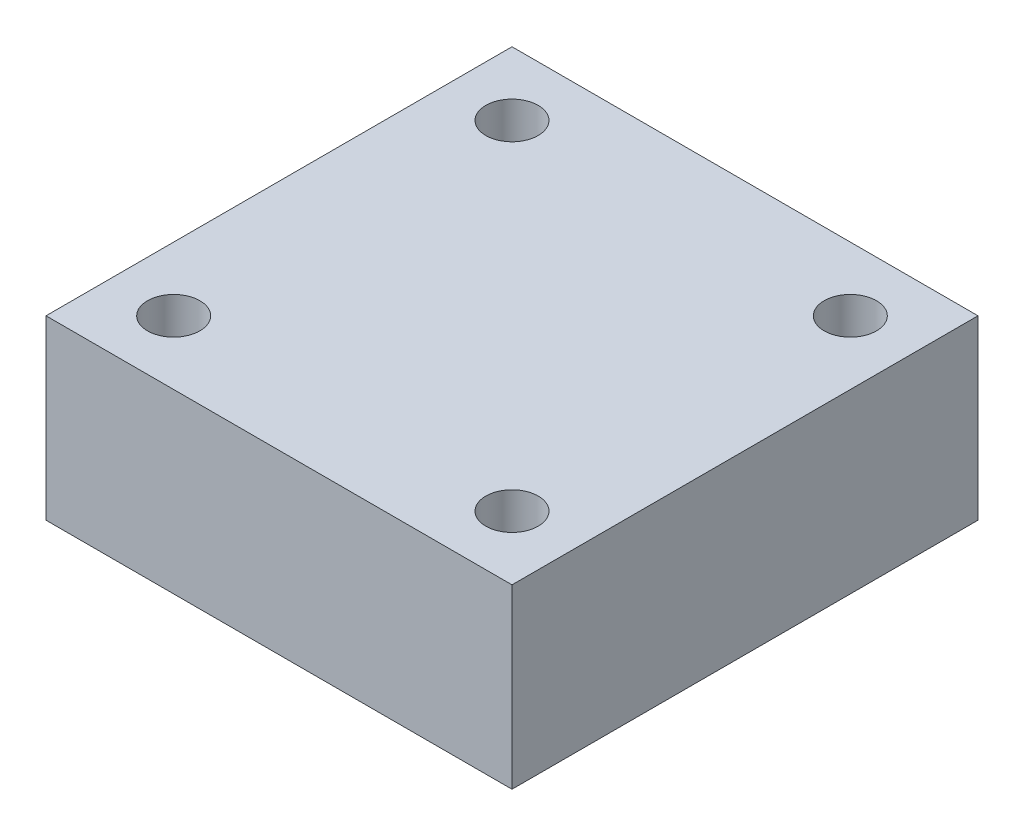
ISO-10303-21;
HEADER;
FILE_DESCRIPTION(('STEP AP214'),'2;1');
FILE_NAME('part.step','',(''),(''),'','','');
FILE_SCHEMA(('AUTOMOTIVE_DESIGN { 1 0 10303 214 1 1 1 1 }'));
ENDSEC;
DATA;
#1=APPLICATION_CONTEXT('core data for automotive mechanical design processes');
#2=APPLICATION_PROTOCOL_DEFINITION('international standard','automotive_design',2000,#1);
#3=PRODUCT_CONTEXT('',#1,'mechanical');
#4=PRODUCT('Part','Part','',(#3));
#5=PRODUCT_RELATED_PRODUCT_CATEGORY('part','',(#4));
#6=PRODUCT_DEFINITION_FORMATION('','',#4);
#7=PRODUCT_DEFINITION_CONTEXT('part definition',#1,'design');
#8=PRODUCT_DEFINITION('design','',#6,#7);
#9=PRODUCT_DEFINITION_SHAPE('','',#8);
#10=(LENGTH_UNIT() NAMED_UNIT(*) SI_UNIT(.MILLI.,.METRE.));
#11=(NAMED_UNIT(*) PLANE_ANGLE_UNIT() SI_UNIT($,.RADIAN.));
#12=(NAMED_UNIT(*) SI_UNIT($,.STERADIAN.) SOLID_ANGLE_UNIT());
#13=UNCERTAINTY_MEASURE_WITH_UNIT(LENGTH_MEASURE(1.E-05),#10,'distance_accuracy_value','');
#14=(GEOMETRIC_REPRESENTATION_CONTEXT(3) GLOBAL_UNCERTAINTY_ASSIGNED_CONTEXT((#13)) GLOBAL_UNIT_ASSIGNED_CONTEXT((#10,
#11,#12)) REPRESENTATION_CONTEXT('',''));
#15=CARTESIAN_POINT('',(0.,0.,0.));
#16=DIRECTION('',(0.,0.,1.));
#17=DIRECTION('',(1.,0.,0.));
#18=AXIS2_PLACEMENT_3D('',#15,#16,#17);
#19=CARTESIAN_POINT('',(0.,27.734,0.));
#20=DIRECTION('',(0.,-1.,0.));
#21=DIRECTION('',(0.,0.,-1.));
#22=AXIS2_PLACEMENT_3D('',#19,#20,#21);
#23=PLANE('',#22);
#24=DIRECTION('',(0.,0.,-1.));
#25=VECTOR('',#24,1.);
#26=CARTESIAN_POINT('',(36.5,27.734,36.5));
#27=LINE('',#26,#25);
#28=CARTESIAN_POINT('',(36.5,27.734,36.5));
#29=VERTEX_POINT('',#28);
#30=CARTESIAN_POINT('',(36.5,27.734,-36.5));
#31=VERTEX_POINT('',#30);
#32=EDGE_CURVE('E92',#29,#31,#27,.T.);
#33=ORIENTED_EDGE('',*,*,#32,.T.);
#34=DIRECTION('',(-1.,0.,0.));
#35=VECTOR('',#34,1.);
#36=CARTESIAN_POINT('',(-36.5,27.734,-36.5));
#37=LINE('',#36,#35);
#38=CARTESIAN_POINT('',(-36.5,27.734,-36.5));
#39=VERTEX_POINT('',#38);
#40=EDGE_CURVE('E87',#31,#39,#37,.T.);
#41=ORIENTED_EDGE('',*,*,#40,.T.);
#42=DIRECTION('',(0.,0.,1.));
#43=VECTOR('',#42,1.);
#44=CARTESIAN_POINT('',(-36.5,27.734,36.5));
#45=LINE('',#44,#43);
#46=CARTESIAN_POINT('',(-36.5,27.734,36.5));
#47=VERTEX_POINT('',#46);
#48=EDGE_CURVE('E90',#39,#47,#45,.T.);
#49=ORIENTED_EDGE('',*,*,#48,.T.);
#50=DIRECTION('',(1.,0.,0.));
#51=VECTOR('',#50,1.);
#52=CARTESIAN_POINT('',(-36.5,27.734,36.5));
#53=LINE('',#52,#51);
#54=EDGE_CURVE('E57',#47,#29,#53,.T.);
#55=ORIENTED_EDGE('',*,*,#54,.T.);
#56=EDGE_LOOP('',(#33,#41,#49,#55));
#57=FACE_BOUND('',#56,.T.);
#58=CARTESIAN_POINT('',(-26.5,27.734,-26.5));
#59=DIRECTION('',(0.,1.,0.));
#60=DIRECTION('',(0.,0.,1.));
#61=AXIS2_PLACEMENT_3D('',#58,#59,#60);
#62=CIRCLE('',#61,4.1);
#63=CARTESIAN_POINT('',(-26.5,27.734,-22.4));
#64=VERTEX_POINT('',#63);
#65=EDGE_CURVE('E112',#64,#64,#62,.T.);
#66=ORIENTED_EDGE('',*,*,#65,.F.);
#67=EDGE_LOOP('',(#66));
#68=FACE_BOUND('',#67,.T.);
#69=CARTESIAN_POINT('',(26.5,27.734,-26.5));
#70=DIRECTION('',(0.,1.,0.));
#71=DIRECTION('',(0.,0.,1.));
#72=AXIS2_PLACEMENT_3D('',#69,#70,#71);
#73=CIRCLE('',#72,4.1);
#74=CARTESIAN_POINT('',(26.5,27.734,-22.4));
#75=VERTEX_POINT('',#74);
#76=EDGE_CURVE('E134',#75,#75,#73,.T.);
#77=ORIENTED_EDGE('',*,*,#76,.F.);
#78=EDGE_LOOP('',(#77));
#79=FACE_BOUND('',#78,.T.);
#80=CARTESIAN_POINT('',(26.5,27.734,26.5));
#81=DIRECTION('',(0.,1.,0.));
#82=DIRECTION('',(0.,0.,1.));
#83=AXIS2_PLACEMENT_3D('',#80,#81,#82);
#84=CIRCLE('',#83,4.1);
#85=CARTESIAN_POINT('',(26.5,27.734,30.6));
#86=VERTEX_POINT('',#85);
#87=EDGE_CURVE('E142',#86,#86,#84,.T.);
#88=ORIENTED_EDGE('',*,*,#87,.F.);
#89=EDGE_LOOP('',(#88));
#90=FACE_BOUND('',#89,.T.);
#91=CARTESIAN_POINT('',(-26.5,27.734,26.5));
#92=DIRECTION('',(0.,1.,0.));
#93=DIRECTION('',(0.,0.,1.));
#94=AXIS2_PLACEMENT_3D('',#91,#92,#93);
#95=CIRCLE('',#94,4.1);
#96=CARTESIAN_POINT('',(-26.5,27.734,30.6));
#97=VERTEX_POINT('',#96);
#98=EDGE_CURVE('E150',#97,#97,#95,.T.);
#99=ORIENTED_EDGE('',*,*,#98,.F.);
#100=EDGE_LOOP('',(#99));
#101=FACE_BOUND('',#100,.T.);
#102=ADVANCED_FACE('F39',(#57,#68,#79,#90,#101),#23,.F.);
#103=CARTESIAN_POINT('',(0.,0.,0.));
#104=DIRECTION('',(0.,-1.,0.));
#105=DIRECTION('',(0.,0.,-1.));
#106=AXIS2_PLACEMENT_3D('',#103,#104,#105);
#107=PLANE('',#106);
#108=CARTESIAN_POINT('',(26.5,0.,26.5));
#109=DIRECTION('',(0.,1.,0.));
#110=DIRECTION('',(0.,0.,1.));
#111=AXIS2_PLACEMENT_3D('',#108,#109,#110);
#112=CIRCLE('',#111,4.1);
#113=CARTESIAN_POINT('',(26.5,0.,30.6));
#114=VERTEX_POINT('',#113);
#115=EDGE_CURVE('E146',#114,#114,#112,.T.);
#116=ORIENTED_EDGE('',*,*,#115,.T.);
#117=EDGE_LOOP('',(#116));
#118=FACE_BOUND('',#117,.T.);
#119=CARTESIAN_POINT('',(-26.5,0.,-26.5));
#120=DIRECTION('',(0.,1.,0.));
#121=DIRECTION('',(0.,0.,1.));
#122=AXIS2_PLACEMENT_3D('',#119,#120,#121);
#123=CIRCLE('',#122,4.1);
#124=CARTESIAN_POINT('',(-26.5,0.,-22.4));
#125=VERTEX_POINT('',#124);
#126=EDGE_CURVE('E130',#125,#125,#123,.T.);
#127=ORIENTED_EDGE('',*,*,#126,.T.);
#128=EDGE_LOOP('',(#127));
#129=FACE_BOUND('',#128,.T.);
#130=DIRECTION('',(0.,0.,-1.));
#131=VECTOR('',#130,1.);
#132=CARTESIAN_POINT('',(36.5,0.,36.5));
#133=LINE('',#132,#131);
#134=CARTESIAN_POINT('',(36.5,0.,36.5));
#135=VERTEX_POINT('',#134);
#136=CARTESIAN_POINT('',(36.5,0.,-36.5));
#137=VERTEX_POINT('',#136);
#138=EDGE_CURVE('E108',#135,#137,#133,.T.);
#139=ORIENTED_EDGE('',*,*,#138,.F.);
#140=DIRECTION('',(1.,0.,0.));
#141=VECTOR('',#140,1.);
#142=CARTESIAN_POINT('',(-36.5,0.,36.5));
#143=LINE('',#142,#141);
#144=CARTESIAN_POINT('',(-36.5,0.,36.5));
#145=VERTEX_POINT('',#144);
#146=EDGE_CURVE('E80',#145,#135,#143,.T.);
#147=ORIENTED_EDGE('',*,*,#146,.F.);
#148=DIRECTION('',(0.,0.,1.));
#149=VECTOR('',#148,1.);
#150=CARTESIAN_POINT('',(-36.5,0.,36.5));
#151=LINE('',#150,#149);
#152=CARTESIAN_POINT('',(-36.5,0.,-36.5));
#153=VERTEX_POINT('',#152);
#154=EDGE_CURVE('E74',#153,#145,#151,.T.);
#155=ORIENTED_EDGE('',*,*,#154,.F.);
#156=DIRECTION('',(-1.,0.,0.));
#157=VECTOR('',#156,1.);
#158=CARTESIAN_POINT('',(-36.5,0.,-36.5));
#159=LINE('',#158,#157);
#160=EDGE_CURVE('E97',#137,#153,#159,.T.);
#161=ORIENTED_EDGE('',*,*,#160,.F.);
#162=EDGE_LOOP('',(#139,#147,#155,#161));
#163=FACE_BOUND('',#162,.T.);
#164=CARTESIAN_POINT('',(26.5,0.,-26.5));
#165=DIRECTION('',(0.,1.,0.));
#166=DIRECTION('',(0.,0.,1.));
#167=AXIS2_PLACEMENT_3D('',#164,#165,#166);
#168=CIRCLE('',#167,4.1);
#169=CARTESIAN_POINT('',(26.5,0.,-22.4));
#170=VERTEX_POINT('',#169);
#171=EDGE_CURVE('E138',#170,#170,#168,.T.);
#172=ORIENTED_EDGE('',*,*,#171,.T.);
#173=EDGE_LOOP('',(#172));
#174=FACE_BOUND('',#173,.T.);
#175=CARTESIAN_POINT('',(-26.5,0.,26.5));
#176=DIRECTION('',(0.,1.,0.));
#177=DIRECTION('',(0.,0.,1.));
#178=AXIS2_PLACEMENT_3D('',#175,#176,#177);
#179=CIRCLE('',#178,4.1);
#180=CARTESIAN_POINT('',(-26.5,0.,30.6));
#181=VERTEX_POINT('',#180);
#182=EDGE_CURVE('E154',#181,#181,#179,.T.);
#183=ORIENTED_EDGE('',*,*,#182,.T.);
#184=EDGE_LOOP('',(#183));
#185=FACE_BOUND('',#184,.T.);
#186=ADVANCED_FACE('F125',(#118,#129,#163,#174,#185),#107,.T.);
#187=CARTESIAN_POINT('',(36.5,27.734,36.5));
#188=DIRECTION('',(-1.,0.,0.));
#189=DIRECTION('',(0.,0.,1.));
#190=AXIS2_PLACEMENT_3D('',#187,#188,#189);
#191=PLANE('',#190);
#192=ORIENTED_EDGE('',*,*,#138,.T.);
#193=DIRECTION('',(0.,-1.,0.));
#194=VECTOR('',#193,1.);
#195=CARTESIAN_POINT('',(36.5,27.734,-36.5));
#196=LINE('',#195,#194);
#197=EDGE_CURVE('E11',#31,#137,#196,.T.);
#198=ORIENTED_EDGE('',*,*,#197,.F.);
#199=ORIENTED_EDGE('',*,*,#32,.F.);
#200=DIRECTION('',(0.,-1.,0.));
#201=VECTOR('',#200,1.);
#202=CARTESIAN_POINT('',(36.5,27.734,36.5));
#203=LINE('',#202,#201);
#204=EDGE_CURVE('E104',#29,#135,#203,.T.);
#205=ORIENTED_EDGE('',*,*,#204,.T.);
#206=EDGE_LOOP('',(#192,#198,#199,#205));
#207=FACE_BOUND('',#206,.T.);
#208=ADVANCED_FACE('F41',(#207),#191,.F.);
#209=CARTESIAN_POINT('',(-36.5,27.734,-36.5));
#210=DIRECTION('',(0.,0.,1.));
#211=DIRECTION('',(1.,0.,0.));
#212=AXIS2_PLACEMENT_3D('',#209,#210,#211);
#213=PLANE('',#212);
#214=ORIENTED_EDGE('',*,*,#160,.T.);
#215=DIRECTION('',(0.,-1.,0.));
#216=VECTOR('',#215,1.);
#217=CARTESIAN_POINT('',(-36.5,27.734,-36.5));
#218=LINE('',#217,#216);
#219=EDGE_CURVE('E49',#39,#153,#218,.T.);
#220=ORIENTED_EDGE('',*,*,#219,.F.);
#221=ORIENTED_EDGE('',*,*,#40,.F.);
#222=ORIENTED_EDGE('',*,*,#197,.T.);
#223=EDGE_LOOP('',(#214,#220,#221,#222));
#224=FACE_BOUND('',#223,.T.);
#225=ADVANCED_FACE('F96',(#224),#213,.F.);
#226=CARTESIAN_POINT('',(-36.5,27.734,36.5));
#227=DIRECTION('',(1.,0.,0.));
#228=DIRECTION('',(0.,0.,-1.));
#229=AXIS2_PLACEMENT_3D('',#226,#227,#228);
#230=PLANE('',#229);
#231=ORIENTED_EDGE('',*,*,#154,.T.);
#232=DIRECTION('',(0.,-1.,0.));
#233=VECTOR('',#232,1.);
#234=CARTESIAN_POINT('',(-36.5,27.734,36.5));
#235=LINE('',#234,#233);
#236=EDGE_CURVE('E99',#47,#145,#235,.T.);
#237=ORIENTED_EDGE('',*,*,#236,.F.);
#238=ORIENTED_EDGE('',*,*,#48,.F.);
#239=ORIENTED_EDGE('',*,*,#219,.T.);
#240=EDGE_LOOP('',(#231,#237,#238,#239));
#241=FACE_BOUND('',#240,.T.);
#242=ADVANCED_FACE('F100',(#241),#230,.F.);
#243=CARTESIAN_POINT('',(-36.5,27.734,36.5));
#244=DIRECTION('',(0.,0.,-1.));
#245=DIRECTION('',(-1.,0.,0.));
#246=AXIS2_PLACEMENT_3D('',#243,#244,#245);
#247=PLANE('',#246);
#248=ORIENTED_EDGE('',*,*,#146,.T.);
#249=ORIENTED_EDGE('',*,*,#204,.F.);
#250=ORIENTED_EDGE('',*,*,#54,.F.);
#251=ORIENTED_EDGE('',*,*,#236,.T.);
#252=EDGE_LOOP('',(#248,#249,#250,#251));
#253=FACE_BOUND('',#252,.T.);
#254=ADVANCED_FACE('F122',(#253),#247,.F.);
#255=CARTESIAN_POINT('',(-26.5,27.734,-26.5));
#256=DIRECTION('',(0.,-1.,0.));
#257=DIRECTION('',(0.,0.,-1.));
#258=AXIS2_PLACEMENT_3D('',#255,#256,#257);
#259=CYLINDRICAL_SURFACE('',#258,4.1);
#260=ORIENTED_EDGE('',*,*,#65,.T.);
#261=EDGE_LOOP('',(#260));
#262=FACE_BOUND('',#261,.T.);
#263=ORIENTED_EDGE('',*,*,#126,.F.);
#264=EDGE_LOOP('',(#263));
#265=FACE_BOUND('',#264,.T.);
#266=ADVANCED_FACE('F173',(#262,#265),#259,.F.);
#267=CARTESIAN_POINT('',(26.5,27.734,-26.5));
#268=DIRECTION('',(0.,-1.,0.));
#269=DIRECTION('',(0.,0.,-1.));
#270=AXIS2_PLACEMENT_3D('',#267,#268,#269);
#271=CYLINDRICAL_SURFACE('',#270,4.1);
#272=ORIENTED_EDGE('',*,*,#76,.T.);
#273=EDGE_LOOP('',(#272));
#274=FACE_BOUND('',#273,.T.);
#275=ORIENTED_EDGE('',*,*,#171,.F.);
#276=EDGE_LOOP('',(#275));
#277=FACE_BOUND('',#276,.T.);
#278=ADVANCED_FACE('F219',(#274,#277),#271,.F.);
#279=CARTESIAN_POINT('',(26.5,27.734,26.5));
#280=DIRECTION('',(0.,-1.,0.));
#281=DIRECTION('',(0.,0.,-1.));
#282=AXIS2_PLACEMENT_3D('',#279,#280,#281);
#283=CYLINDRICAL_SURFACE('',#282,4.1);
#284=ORIENTED_EDGE('',*,*,#87,.T.);
#285=EDGE_LOOP('',(#284));
#286=FACE_BOUND('',#285,.T.);
#287=ORIENTED_EDGE('',*,*,#115,.F.);
#288=EDGE_LOOP('',(#287));
#289=FACE_BOUND('',#288,.T.);
#290=ADVANCED_FACE('F227',(#286,#289),#283,.F.);
#291=CARTESIAN_POINT('',(-26.5,27.734,26.5));
#292=DIRECTION('',(0.,-1.,0.));
#293=DIRECTION('',(0.,0.,-1.));
#294=AXIS2_PLACEMENT_3D('',#291,#292,#293);
#295=CYLINDRICAL_SURFACE('',#294,4.1);
#296=ORIENTED_EDGE('',*,*,#98,.T.);
#297=EDGE_LOOP('',(#296));
#298=FACE_BOUND('',#297,.T.);
#299=ORIENTED_EDGE('',*,*,#182,.F.);
#300=EDGE_LOOP('',(#299));
#301=FACE_BOUND('',#300,.T.);
#302=ADVANCED_FACE('F162',(#298,#301),#295,.F.);
#303=CLOSED_SHELL('',(#102,#186,#208,#225,#242,#254,#266,#278,#290,#302));
#304=MANIFOLD_SOLID_BREP('B2',#303);
#305=ADVANCED_BREP_SHAPE_REPRESENTATION('',(#18,#304),#14);
#306=SHAPE_DEFINITION_REPRESENTATION(#9,#305);
ENDSEC;
END-ISO-10303-21;
